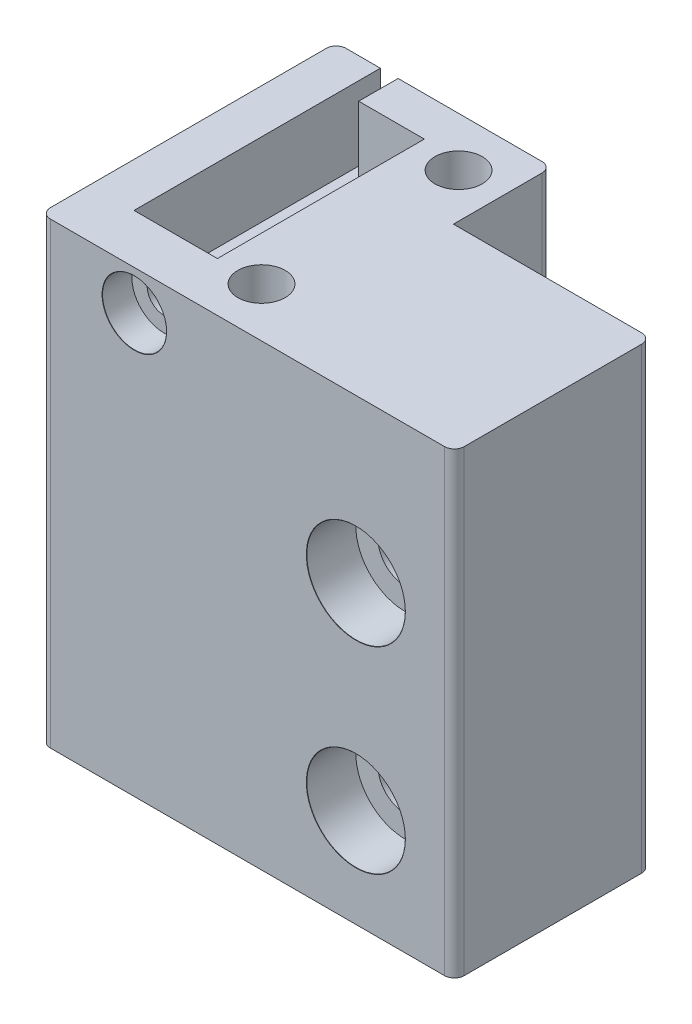
ISO-10303-21;
HEADER;
FILE_DESCRIPTION(('STEP AP214'),'2;1');
FILE_NAME('part.step','',(''),(''),'','','');
FILE_SCHEMA(('AUTOMOTIVE_DESIGN { 1 0 10303 214 1 1 1 1 }'));
ENDSEC;
DATA;
#1=APPLICATION_CONTEXT('core data for automotive mechanical design processes');
#2=APPLICATION_PROTOCOL_DEFINITION('international standard','automotive_design',2000,#1);
#3=PRODUCT_CONTEXT('',#1,'mechanical');
#4=PRODUCT('Part','Part','',(#3));
#5=PRODUCT_RELATED_PRODUCT_CATEGORY('part','',(#4));
#6=PRODUCT_DEFINITION_FORMATION('','',#4);
#7=PRODUCT_DEFINITION_CONTEXT('part definition',#1,'design');
#8=PRODUCT_DEFINITION('design','',#6,#7);
#9=PRODUCT_DEFINITION_SHAPE('','',#8);
#10=(LENGTH_UNIT() NAMED_UNIT(*) SI_UNIT(.MILLI.,.METRE.));
#11=(NAMED_UNIT(*) PLANE_ANGLE_UNIT() SI_UNIT($,.RADIAN.));
#12=(NAMED_UNIT(*) SI_UNIT($,.STERADIAN.) SOLID_ANGLE_UNIT());
#13=UNCERTAINTY_MEASURE_WITH_UNIT(LENGTH_MEASURE(1.E-05),#10,'distance_accuracy_value','');
#14=(GEOMETRIC_REPRESENTATION_CONTEXT(3) GLOBAL_UNCERTAINTY_ASSIGNED_CONTEXT((#13)) GLOBAL_UNIT_ASSIGNED_CONTEXT((#10,
#11,#12)) REPRESENTATION_CONTEXT('',''));
#15=CARTESIAN_POINT('',(0.,0.,0.));
#16=DIRECTION('',(0.,0.,1.));
#17=DIRECTION('',(1.,0.,0.));
#18=AXIS2_PLACEMENT_3D('',#15,#16,#17);
#19=CARTESIAN_POINT('',(-21.,40.,-10.));
#20=DIRECTION('',(1.,0.,0.));
#21=DIRECTION('',(0.,0.,-1.));
#22=AXIS2_PLACEMENT_3D('',#19,#20,#21);
#23=PLANE('',#22);
#24=DIRECTION('',(0.,0.,1.));
#25=VECTOR('',#24,1.);
#26=CARTESIAN_POINT('',(-21.,46.5,-10.));
#27=LINE('',#26,#25);
#28=CARTESIAN_POINT('',(-21.,46.5,-19.));
#29=VERTEX_POINT('',#28);
#30=CARTESIAN_POINT('',(-21.,46.5,9.00000000000001));
#31=VERTEX_POINT('',#30);
#32=EDGE_CURVE('E224',#29,#31,#27,.T.);
#33=ORIENTED_EDGE('',*,*,#32,.F.);
#34=DIRECTION('',(0.,1.,0.));
#35=VECTOR('',#34,1.);
#36=CARTESIAN_POINT('',(-21.,0.,-19.));
#37=LINE('',#36,#35);
#38=CARTESIAN_POINT('',(-21.,0.,-19.));
#39=VERTEX_POINT('',#38);
#40=EDGE_CURVE('E11',#29,#39,#37,.F.);
#41=ORIENTED_EDGE('',*,*,#40,.T.);
#42=DIRECTION('',(0.,0.,1.));
#43=VECTOR('',#42,1.);
#44=CARTESIAN_POINT('',(-21.,0.,-10.));
#45=LINE('',#44,#43);
#46=CARTESIAN_POINT('',(-21.,0.,9.00000000000001));
#47=VERTEX_POINT('',#46);
#48=EDGE_CURVE('E276',#39,#47,#45,.T.);
#49=ORIENTED_EDGE('',*,*,#48,.T.);
#50=DIRECTION('',(0.,-1.,0.));
#51=VECTOR('',#50,1.);
#52=CARTESIAN_POINT('',(-21.,40.,9.00000000000001));
#53=LINE('',#52,#51);
#54=EDGE_CURVE('E52',#47,#31,#53,.F.);
#55=ORIENTED_EDGE('',*,*,#54,.T.);
#56=EDGE_LOOP('',(#33,#41,#49,#55));
#57=FACE_BOUND('',#56,.T.);
#58=ADVANCED_FACE('F43',(#57),#23,.F.);
#59=CARTESIAN_POINT('',(21.,40.,10.));
#60=DIRECTION('',(0.,0.,-1.));
#61=DIRECTION('',(-1.,0.,0.));
#62=AXIS2_PLACEMENT_3D('',#59,#60,#61);
#63=PLANE('',#62);
#64=CARTESIAN_POINT('',(-11.4799999999989,42.5,10.));
#65=DIRECTION('',(0.,0.,1.));
#66=DIRECTION('',(1.,0.,0.));
#67=AXIS2_PLACEMENT_3D('',#64,#65,#66);
#68=CIRCLE('',#67,3.275);
#69=CARTESIAN_POINT('',(-8.20499999999888,42.5,10.));
#70=VERTEX_POINT('',#69);
#71=EDGE_CURVE('E445',#70,#70,#68,.T.);
#72=ORIENTED_EDGE('',*,*,#71,.F.);
#73=EDGE_LOOP('',(#72));
#74=FACE_BOUND('',#73,.T.);
#75=CARTESIAN_POINT('',(11.,30.,10.));
#76=DIRECTION('',(0.,0.,1.));
#77=DIRECTION('',(1.,0.,0.));
#78=AXIS2_PLACEMENT_3D('',#75,#76,#77);
#79=CIRCLE('',#78,5.025);
#80=CARTESIAN_POINT('',(16.025,30.,10.));
#81=VERTEX_POINT('',#80);
#82=EDGE_CURVE('E236',#81,#81,#79,.T.);
#83=ORIENTED_EDGE('',*,*,#82,.F.);
#84=EDGE_LOOP('',(#83));
#85=FACE_BOUND('',#84,.T.);
#86=CARTESIAN_POINT('',(11.,10.,10.));
#87=DIRECTION('',(0.,0.,1.));
#88=DIRECTION('',(1.,0.,0.));
#89=AXIS2_PLACEMENT_3D('',#86,#87,#88);
#90=CIRCLE('',#89,5.025);
#91=CARTESIAN_POINT('',(16.025,10.,10.));
#92=VERTEX_POINT('',#91);
#93=EDGE_CURVE('E256',#92,#92,#90,.T.);
#94=ORIENTED_EDGE('',*,*,#93,.F.);
#95=EDGE_LOOP('',(#94));
#96=FACE_BOUND('',#95,.T.);
#97=DIRECTION('',(1.,0.,0.));
#98=VECTOR('',#97,1.);
#99=CARTESIAN_POINT('',(21.,0.,10.));
#100=LINE('',#99,#98);
#101=CARTESIAN_POINT('',(-20.,0.,10.));
#102=VERTEX_POINT('',#101);
#103=CARTESIAN_POINT('',(20.,0.,10.));
#104=VERTEX_POINT('',#103);
#105=EDGE_CURVE('E280',#102,#104,#100,.T.);
#106=ORIENTED_EDGE('',*,*,#105,.T.);
#107=DIRECTION('',(0.,-1.,0.));
#108=VECTOR('',#107,1.);
#109=CARTESIAN_POINT('',(20.,40.,10.));
#110=LINE('',#109,#108);
#111=CARTESIAN_POINT('',(20.,46.5,10.));
#112=VERTEX_POINT('',#111);
#113=EDGE_CURVE('E344',#104,#112,#110,.F.);
#114=ORIENTED_EDGE('',*,*,#113,.T.);
#115=DIRECTION('',(1.,0.,0.));
#116=VECTOR('',#115,1.);
#117=CARTESIAN_POINT('',(-21.,46.5,10.));
#118=LINE('',#117,#116);
#119=CARTESIAN_POINT('',(-20.,46.5,10.));
#120=VERTEX_POINT('',#119);
#121=EDGE_CURVE('E228',#120,#112,#118,.T.);
#122=ORIENTED_EDGE('',*,*,#121,.F.);
#123=DIRECTION('',(0.,-1.,0.));
#124=VECTOR('',#123,1.);
#125=CARTESIAN_POINT('',(-20.,40.,10.));
#126=LINE('',#125,#124);
#127=EDGE_CURVE('E340',#120,#102,#126,.T.);
#128=ORIENTED_EDGE('',*,*,#127,.T.);
#129=EDGE_LOOP('',(#106,#114,#122,#128));
#130=FACE_BOUND('',#129,.T.);
#131=ADVANCED_FACE('F359',(#74,#85,#96,#130),#63,.F.);
#132=CARTESIAN_POINT('',(21.,40.,-10.));
#133=DIRECTION('',(-1.,0.,0.));
#134=DIRECTION('',(0.,0.,1.));
#135=AXIS2_PLACEMENT_3D('',#132,#133,#134);
#136=PLANE('',#135);
#137=DIRECTION('',(0.,0.,-1.));
#138=VECTOR('',#137,1.);
#139=CARTESIAN_POINT('',(21.,0.,-10.));
#140=LINE('',#139,#138);
#141=CARTESIAN_POINT('',(21.,0.,9.));
#142=VERTEX_POINT('',#141);
#143=CARTESIAN_POINT('',(21.,0.,-9.00000000000001));
#144=VERTEX_POINT('',#143);
#145=EDGE_CURVE('E284',#142,#144,#140,.T.);
#146=ORIENTED_EDGE('',*,*,#145,.T.);
#147=DIRECTION('',(0.,-1.,0.));
#148=VECTOR('',#147,1.);
#149=CARTESIAN_POINT('',(21.,40.,-9.00000000000001));
#150=LINE('',#149,#148);
#151=CARTESIAN_POINT('',(21.,46.5,-9.00000000000001));
#152=VERTEX_POINT('',#151);
#153=EDGE_CURVE('E314',#144,#152,#150,.F.);
#154=ORIENTED_EDGE('',*,*,#153,.T.);
#155=DIRECTION('',(0.,0.,-1.));
#156=VECTOR('',#155,1.);
#157=CARTESIAN_POINT('',(21.,46.5,10.));
#158=LINE('',#157,#156);
#159=CARTESIAN_POINT('',(21.,46.5,9.));
#160=VERTEX_POINT('',#159);
#161=EDGE_CURVE('E232',#160,#152,#158,.T.);
#162=ORIENTED_EDGE('',*,*,#161,.F.);
#163=DIRECTION('',(0.,-1.,0.));
#164=VECTOR('',#163,1.);
#165=CARTESIAN_POINT('',(21.,40.,9.));
#166=LINE('',#165,#164);
#167=EDGE_CURVE('E310',#160,#142,#166,.T.);
#168=ORIENTED_EDGE('',*,*,#167,.T.);
#169=EDGE_LOOP('',(#146,#154,#162,#168));
#170=FACE_BOUND('',#169,.T.);
#171=ADVANCED_FACE('F371',(#170),#136,.F.);
#172=CARTESIAN_POINT('',(21.,40.,-10.));
#173=DIRECTION('',(0.,0.,1.));
#174=DIRECTION('',(1.,0.,0.));
#175=AXIS2_PLACEMENT_3D('',#172,#173,#174);
#176=PLANE('',#175);
#177=CARTESIAN_POINT('',(11.,30.,-10.));
#178=DIRECTION('',(0.,0.,1.));
#179=DIRECTION('',(1.,0.,0.));
#180=AXIS2_PLACEMENT_3D('',#177,#178,#179);
#181=CIRCLE('',#180,2.75);
#182=CARTESIAN_POINT('',(13.75,30.,-10.));
#183=VERTEX_POINT('',#182);
#184=EDGE_CURVE('E252',#183,#183,#181,.T.);
#185=ORIENTED_EDGE('',*,*,#184,.T.);
#186=EDGE_LOOP('',(#185));
#187=FACE_BOUND('',#186,.T.);
#188=CARTESIAN_POINT('',(11.,10.,-10.));
#189=DIRECTION('',(0.,0.,1.));
#190=DIRECTION('',(1.,0.,0.));
#191=AXIS2_PLACEMENT_3D('',#188,#189,#190);
#192=CIRCLE('',#191,2.75);
#193=CARTESIAN_POINT('',(13.75,10.,-10.));
#194=VERTEX_POINT('',#193);
#195=EDGE_CURVE('E272',#194,#194,#192,.T.);
#196=ORIENTED_EDGE('',*,*,#195,.T.);
#197=EDGE_LOOP('',(#196));
#198=FACE_BOUND('',#197,.T.);
#199=DIRECTION('',(-1.,0.,0.));
#200=VECTOR('',#199,1.);
#201=CARTESIAN_POINT('',(21.,46.5,-10.));
#202=LINE('',#201,#200);
#203=CARTESIAN_POINT('',(20.,46.5,-10.));
#204=VERTEX_POINT('',#203);
#205=CARTESIAN_POINT('',(0.900000000000008,46.5,-10.));
#206=VERTEX_POINT('',#205);
#207=EDGE_CURVE('E214',#204,#206,#202,.T.);
#208=ORIENTED_EDGE('',*,*,#207,.F.);
#209=DIRECTION('',(0.,-1.,0.));
#210=VECTOR('',#209,1.);
#211=CARTESIAN_POINT('',(20.,40.,-10.));
#212=LINE('',#211,#210);
#213=CARTESIAN_POINT('',(20.,0.,-10.));
#214=VERTEX_POINT('',#213);
#215=EDGE_CURVE('E291',#204,#214,#212,.T.);
#216=ORIENTED_EDGE('',*,*,#215,.T.);
#217=DIRECTION('',(-1.,0.,0.));
#218=VECTOR('',#217,1.);
#219=CARTESIAN_POINT('',(21.,0.,-10.));
#220=LINE('',#219,#218);
#221=CARTESIAN_POINT('',(0.900000000000001,0.,-10.));
#222=VERTEX_POINT('',#221);
#223=EDGE_CURVE('E288',#214,#222,#220,.T.);
#224=ORIENTED_EDGE('',*,*,#223,.T.);
#225=DIRECTION('',(0.,1.,0.));
#226=VECTOR('',#225,1.);
#227=CARTESIAN_POINT('',(0.900000000000001,-24.0750908617185,-10.));
#228=LINE('',#227,#226);
#229=EDGE_CURVE('E205',#222,#206,#228,.T.);
#230=ORIENTED_EDGE('',*,*,#229,.T.);
#231=EDGE_LOOP('',(#208,#216,#224,#230));
#232=FACE_BOUND('',#231,.T.);
#233=ADVANCED_FACE('F379',(#187,#198,#232),#176,.F.);
#234=CARTESIAN_POINT('',(0.,0.,0.));
#235=DIRECTION('',(0.,-1.,0.));
#236=DIRECTION('',(0.,0.,-1.));
#237=AXIS2_PLACEMENT_3D('',#234,#235,#236);
#238=PLANE('',#237);
#239=ORIENTED_EDGE('',*,*,#223,.F.);
#240=CARTESIAN_POINT('',(20.,0.,-9.00000000000001));
#241=DIRECTION('',(0.,-1.,0.));
#242=DIRECTION('',(0.,0.,-1.));
#243=AXIS2_PLACEMENT_3D('',#240,#241,#242);
#244=CIRCLE('',#243,1.);
#245=EDGE_CURVE('E307',#214,#144,#244,.T.);
#246=ORIENTED_EDGE('',*,*,#245,.T.);
#247=ORIENTED_EDGE('',*,*,#145,.F.);
#248=CARTESIAN_POINT('',(20.,0.,9.));
#249=DIRECTION('',(0.,-1.,0.));
#250=DIRECTION('',(0.,0.,-1.));
#251=AXIS2_PLACEMENT_3D('',#248,#249,#250);
#252=CIRCLE('',#251,1.);
#253=EDGE_CURVE('E301',#142,#104,#252,.T.);
#254=ORIENTED_EDGE('',*,*,#253,.T.);
#255=ORIENTED_EDGE('',*,*,#105,.F.);
#256=CARTESIAN_POINT('',(-20.,0.,9.));
#257=DIRECTION('',(0.,-1.,0.));
#258=DIRECTION('',(0.,0.,-1.));
#259=AXIS2_PLACEMENT_3D('',#256,#257,#258);
#260=CIRCLE('',#259,1.);
#261=EDGE_CURVE('E295',#102,#47,#260,.T.);
#262=ORIENTED_EDGE('',*,*,#261,.T.);
#263=ORIENTED_EDGE('',*,*,#48,.F.);
#264=CARTESIAN_POINT('',(-20.,0.,-19.));
#265=DIRECTION('',(0.,-1.,0.));
#266=DIRECTION('',(0.,0.,-1.));
#267=AXIS2_PLACEMENT_3D('',#264,#265,#266);
#268=CIRCLE('',#267,1.);
#269=CARTESIAN_POINT('',(-20.,0.,-20.));
#270=VERTEX_POINT('',#269);
#271=EDGE_CURVE('E298',#39,#270,#268,.T.);
#272=ORIENTED_EDGE('',*,*,#271,.T.);
#273=DIRECTION('',(-1.,0.,0.));
#274=VECTOR('',#273,1.);
#275=CARTESIAN_POINT('',(-21.,0.,-20.));
#276=LINE('',#275,#274);
#277=CARTESIAN_POINT('',(-0.0999999999999994,0.,-20.));
#278=VERTEX_POINT('',#277);
#279=EDGE_CURVE('E210',#278,#270,#276,.T.);
#280=ORIENTED_EDGE('',*,*,#279,.F.);
#281=CARTESIAN_POINT('',(-0.0999999999999985,0.,-19.));
#282=DIRECTION('',(0.,-1.,0.));
#283=DIRECTION('',(0.,0.,-1.));
#284=AXIS2_PLACEMENT_3D('',#281,#282,#283);
#285=CIRCLE('',#284,1.);
#286=CARTESIAN_POINT('',(0.900000000000001,0.,-19.));
#287=VERTEX_POINT('',#286);
#288=EDGE_CURVE('E304',#278,#287,#285,.T.);
#289=ORIENTED_EDGE('',*,*,#288,.T.);
#290=DIRECTION('',(0.,0.,-1.));
#291=VECTOR('',#290,1.);
#292=CARTESIAN_POINT('',(0.900000000000001,0.,-10.));
#293=LINE('',#292,#291);
#294=EDGE_CURVE('E215',#222,#287,#293,.T.);
#295=ORIENTED_EDGE('',*,*,#294,.F.);
#296=EDGE_LOOP('',(#239,#246,#247,#254,#255,#262,#263,#272,#280,#289,#295));
#297=FACE_BOUND('',#296,.T.);
#298=ADVANCED_FACE('F363',(#297),#238,.T.);
#299=CARTESIAN_POINT('',(11.,10.,10.));
#300=DIRECTION('',(0.,0.,1.));
#301=DIRECTION('',(1.,0.,0.));
#302=AXIS2_PLACEMENT_3D('',#299,#300,#301);
#303=CYLINDRICAL_SURFACE('',#302,2.75);
#304=ORIENTED_EDGE('',*,*,#195,.F.);
#305=EDGE_LOOP('',(#304));
#306=FACE_BOUND('',#305,.T.);
#307=CARTESIAN_POINT('',(11.,10.,5.));
#308=DIRECTION('',(0.,0.,1.));
#309=DIRECTION('',(1.,0.,0.));
#310=AXIS2_PLACEMENT_3D('',#307,#308,#309);
#311=CIRCLE('',#310,2.75);
#312=CARTESIAN_POINT('',(13.75,10.,5.));
#313=VERTEX_POINT('',#312);
#314=EDGE_CURVE('E268',#313,#313,#311,.T.);
#315=ORIENTED_EDGE('',*,*,#314,.T.);
#316=EDGE_LOOP('',(#315));
#317=FACE_BOUND('',#316,.T.);
#318=ADVANCED_FACE('F610',(#306,#317),#303,.F.);
#319=CARTESIAN_POINT('',(16.,10.,5.));
#320=DIRECTION('',(0.,0.,-1.));
#321=DIRECTION('',(-1.,0.,0.));
#322=AXIS2_PLACEMENT_3D('',#319,#320,#321);
#323=PLANE('',#322);
#324=ORIENTED_EDGE('',*,*,#314,.F.);
#325=EDGE_LOOP('',(#324));
#326=FACE_BOUND('',#325,.T.);
#327=CARTESIAN_POINT('',(11.,10.,5.));
#328=DIRECTION('',(0.,0.,1.));
#329=DIRECTION('',(1.,0.,0.));
#330=AXIS2_PLACEMENT_3D('',#327,#328,#329);
#331=CIRCLE('',#330,5.);
#332=CARTESIAN_POINT('',(16.,10.,5.));
#333=VERTEX_POINT('',#332);
#334=EDGE_CURVE('E264',#333,#333,#331,.T.);
#335=ORIENTED_EDGE('',*,*,#334,.T.);
#336=EDGE_LOOP('',(#335));
#337=FACE_BOUND('',#336,.T.);
#338=ADVANCED_FACE('F606',(#326,#337),#323,.F.);
#339=CARTESIAN_POINT('',(11.,10.,10.));
#340=DIRECTION('',(0.,0.,1.));
#341=DIRECTION('',(1.,0.,0.));
#342=AXIS2_PLACEMENT_3D('',#339,#340,#341);
#343=CYLINDRICAL_SURFACE('',#342,5.);
#344=ORIENTED_EDGE('',*,*,#334,.F.);
#345=EDGE_LOOP('',(#344));
#346=FACE_BOUND('',#345,.T.);
#347=CARTESIAN_POINT('',(11.,10.,9.97902250922057));
#348=DIRECTION('',(0.,0.,1.));
#349=DIRECTION('',(1.,0.,0.));
#350=AXIS2_PLACEMENT_3D('',#347,#348,#349);
#351=CIRCLE('',#350,5.);
#352=CARTESIAN_POINT('',(16.,10.,9.97902250922057));
#353=VERTEX_POINT('',#352);
#354=EDGE_CURVE('E260',#353,#353,#351,.T.);
#355=ORIENTED_EDGE('',*,*,#354,.T.);
#356=EDGE_LOOP('',(#355));
#357=FACE_BOUND('',#356,.T.);
#358=ADVANCED_FACE('F602',(#346,#357),#343,.F.);
#359=CARTESIAN_POINT('',(11.,10.,10.));
#360=DIRECTION('',(0.,0.,1.));
#361=DIRECTION('',(1.,0.,0.));
#362=AXIS2_PLACEMENT_3D('',#359,#360,#361);
#363=CONICAL_SURFACE('',#362,5.025,0.872664625997186);
#364=ORIENTED_EDGE('',*,*,#354,.F.);
#365=EDGE_LOOP('',(#364));
#366=FACE_BOUND('',#365,.T.);
#367=ORIENTED_EDGE('',*,*,#93,.T.);
#368=EDGE_LOOP('',(#367));
#369=FACE_BOUND('',#368,.T.);
#370=ADVANCED_FACE('F598',(#366,#369),#363,.F.);
#371=CARTESIAN_POINT('',(11.,30.,10.));
#372=DIRECTION('',(0.,0.,1.));
#373=DIRECTION('',(1.,0.,0.));
#374=AXIS2_PLACEMENT_3D('',#371,#372,#373);
#375=CYLINDRICAL_SURFACE('',#374,2.75);
#376=ORIENTED_EDGE('',*,*,#184,.F.);
#377=EDGE_LOOP('',(#376));
#378=FACE_BOUND('',#377,.T.);
#379=CARTESIAN_POINT('',(11.,30.,5.));
#380=DIRECTION('',(0.,0.,1.));
#381=DIRECTION('',(1.,0.,0.));
#382=AXIS2_PLACEMENT_3D('',#379,#380,#381);
#383=CIRCLE('',#382,2.75);
#384=CARTESIAN_POINT('',(13.75,30.,5.));
#385=VERTEX_POINT('',#384);
#386=EDGE_CURVE('E248',#385,#385,#383,.T.);
#387=ORIENTED_EDGE('',*,*,#386,.T.);
#388=EDGE_LOOP('',(#387));
#389=FACE_BOUND('',#388,.T.);
#390=ADVANCED_FACE('F594',(#378,#389),#375,.F.);
#391=CARTESIAN_POINT('',(16.,30.,5.));
#392=DIRECTION('',(0.,0.,-1.));
#393=DIRECTION('',(-1.,0.,0.));
#394=AXIS2_PLACEMENT_3D('',#391,#392,#393);
#395=PLANE('',#394);
#396=ORIENTED_EDGE('',*,*,#386,.F.);
#397=EDGE_LOOP('',(#396));
#398=FACE_BOUND('',#397,.T.);
#399=CARTESIAN_POINT('',(11.,30.,5.));
#400=DIRECTION('',(0.,0.,1.));
#401=DIRECTION('',(1.,0.,0.));
#402=AXIS2_PLACEMENT_3D('',#399,#400,#401);
#403=CIRCLE('',#402,5.);
#404=CARTESIAN_POINT('',(16.,30.,5.));
#405=VERTEX_POINT('',#404);
#406=EDGE_CURVE('E244',#405,#405,#403,.T.);
#407=ORIENTED_EDGE('',*,*,#406,.T.);
#408=EDGE_LOOP('',(#407));
#409=FACE_BOUND('',#408,.T.);
#410=ADVANCED_FACE('F590',(#398,#409),#395,.F.);
#411=CARTESIAN_POINT('',(11.,30.,10.));
#412=DIRECTION('',(0.,0.,1.));
#413=DIRECTION('',(1.,0.,0.));
#414=AXIS2_PLACEMENT_3D('',#411,#412,#413);
#415=CYLINDRICAL_SURFACE('',#414,5.);
#416=ORIENTED_EDGE('',*,*,#406,.F.);
#417=EDGE_LOOP('',(#416));
#418=FACE_BOUND('',#417,.T.);
#419=CARTESIAN_POINT('',(11.,30.,9.97902250922057));
#420=DIRECTION('',(0.,0.,1.));
#421=DIRECTION('',(1.,0.,0.));
#422=AXIS2_PLACEMENT_3D('',#419,#420,#421);
#423=CIRCLE('',#422,5.);
#424=CARTESIAN_POINT('',(16.,30.,9.97902250922057));
#425=VERTEX_POINT('',#424);
#426=EDGE_CURVE('E240',#425,#425,#423,.T.);
#427=ORIENTED_EDGE('',*,*,#426,.T.);
#428=EDGE_LOOP('',(#427));
#429=FACE_BOUND('',#428,.T.);
#430=ADVANCED_FACE('F586',(#418,#429),#415,.F.);
#431=CARTESIAN_POINT('',(11.,30.,10.));
#432=DIRECTION('',(0.,0.,1.));
#433=DIRECTION('',(1.,0.,0.));
#434=AXIS2_PLACEMENT_3D('',#431,#432,#433);
#435=CONICAL_SURFACE('',#434,5.025,0.872664625997186);
#436=ORIENTED_EDGE('',*,*,#426,.F.);
#437=EDGE_LOOP('',(#436));
#438=FACE_BOUND('',#437,.T.);
#439=ORIENTED_EDGE('',*,*,#82,.T.);
#440=EDGE_LOOP('',(#439));
#441=FACE_BOUND('',#440,.T.);
#442=ADVANCED_FACE('F508',(#438,#441),#435,.F.);
#443=CARTESIAN_POINT('',(0.,46.5,0.));
#444=DIRECTION('',(0.,1.,0.));
#445=DIRECTION('',(0.,0.,1.));
#446=AXIS2_PLACEMENT_3D('',#443,#444,#445);
#447=PLANE('',#446);
#448=CARTESIAN_POINT('',(-3.57499999999999,46.5,-15.));
#449=DIRECTION('',(0.,1.,0.));
#450=DIRECTION('',(0.,0.,1.));
#451=AXIS2_PLACEMENT_3D('',#448,#449,#450);
#452=CIRCLE('',#451,2.4);
#453=CARTESIAN_POINT('',(-3.57499999999999,46.5,-12.6));
#454=VERTEX_POINT('',#453);
#455=EDGE_CURVE('E462',#454,#454,#452,.T.);
#456=ORIENTED_EDGE('',*,*,#455,.F.);
#457=EDGE_LOOP('',(#456));
#458=FACE_BOUND('',#457,.T.);
#459=CARTESIAN_POINT('',(-3.57499999999999,46.5,5.));
#460=DIRECTION('',(0.,1.,0.));
#461=DIRECTION('',(0.,0.,1.));
#462=AXIS2_PLACEMENT_3D('',#459,#460,#461);
#463=CIRCLE('',#462,2.4);
#464=CARTESIAN_POINT('',(-3.57499999999999,46.5,7.4));
#465=VERTEX_POINT('',#464);
#466=EDGE_CURVE('E457',#465,#465,#463,.T.);
#467=ORIENTED_EDGE('',*,*,#466,.F.);
#468=EDGE_LOOP('',(#467));
#469=FACE_BOUND('',#468,.T.);
#470=ORIENTED_EDGE('',*,*,#161,.T.);
#471=CARTESIAN_POINT('',(20.,46.5,-9.00000000000001));
#472=DIRECTION('',(0.,1.,0.));
#473=DIRECTION('',(0.,0.,1.));
#474=AXIS2_PLACEMENT_3D('',#471,#472,#473);
#475=CIRCLE('',#474,1.);
#476=EDGE_CURVE('E328',#152,#204,#475,.T.);
#477=ORIENTED_EDGE('',*,*,#476,.T.);
#478=ORIENTED_EDGE('',*,*,#207,.T.);
#479=DIRECTION('',(0.,0.,-1.));
#480=VECTOR('',#479,1.);
#481=CARTESIAN_POINT('',(0.900000000000001,46.5,-10.));
#482=LINE('',#481,#480);
#483=CARTESIAN_POINT('',(0.900000000000001,46.5,-19.));
#484=VERTEX_POINT('',#483);
#485=EDGE_CURVE('E206',#206,#484,#482,.T.);
#486=ORIENTED_EDGE('',*,*,#485,.T.);
#487=CARTESIAN_POINT('',(-0.0999999999999985,46.5,-19.));
#488=DIRECTION('',(0.,1.,0.));
#489=DIRECTION('',(0.,0.,1.));
#490=AXIS2_PLACEMENT_3D('',#487,#488,#489);
#491=CIRCLE('',#490,1.);
#492=CARTESIAN_POINT('',(-0.0999999999999994,46.5,-20.));
#493=VERTEX_POINT('',#492);
#494=EDGE_CURVE('E59',#484,#493,#491,.T.);
#495=ORIENTED_EDGE('',*,*,#494,.T.);
#496=DIRECTION('',(-1.,0.,0.));
#497=VECTOR('',#496,1.);
#498=CARTESIAN_POINT('',(-21.,46.5,-20.));
#499=LINE('',#498,#497);
#500=CARTESIAN_POINT('',(-14.71,46.5,-20.));
#501=VERTEX_POINT('',#500);
#502=EDGE_CURVE('E202',#493,#501,#499,.T.);
#503=ORIENTED_EDGE('',*,*,#502,.T.);
#504=DIRECTION('',(0.,0.,-1.));
#505=VECTOR('',#504,1.);
#506=CARTESIAN_POINT('',(-14.71,46.5,-16.));
#507=LINE('',#506,#505);
#508=CARTESIAN_POINT('',(-14.71,46.5,-16.));
#509=VERTEX_POINT('',#508);
#510=EDGE_CURVE('E185',#509,#501,#507,.T.);
#511=ORIENTED_EDGE('',*,*,#510,.F.);
#512=DIRECTION('',(-1.,0.,0.));
#513=VECTOR('',#512,1.);
#514=CARTESIAN_POINT('',(-8.05,46.5,-16.));
#515=LINE('',#514,#513);
#516=CARTESIAN_POINT('',(-8.05,46.5,-16.));
#517=VERTEX_POINT('',#516);
#518=EDGE_CURVE('E412',#517,#509,#515,.T.);
#519=ORIENTED_EDGE('',*,*,#518,.F.);
#520=DIRECTION('',(0.,0.,-1.));
#521=VECTOR('',#520,1.);
#522=CARTESIAN_POINT('',(-8.05,46.5,5.));
#523=LINE('',#522,#521);
#524=CARTESIAN_POINT('',(-8.05,46.5,5.));
#525=VERTEX_POINT('',#524);
#526=EDGE_CURVE('E416',#525,#517,#523,.T.);
#527=ORIENTED_EDGE('',*,*,#526,.F.);
#528=DIRECTION('',(1.,0.,0.));
#529=VECTOR('',#528,1.);
#530=CARTESIAN_POINT('',(-16.51,46.5,5.));
#531=LINE('',#530,#529);
#532=CARTESIAN_POINT('',(-16.51,46.5,5.));
#533=VERTEX_POINT('',#532);
#534=EDGE_CURVE('E419',#533,#525,#531,.T.);
#535=ORIENTED_EDGE('',*,*,#534,.F.);
#536=DIRECTION('',(0.,0.,1.));
#537=VECTOR('',#536,1.);
#538=CARTESIAN_POINT('',(-16.51,46.5,-20.));
#539=LINE('',#538,#537);
#540=CARTESIAN_POINT('',(-16.51,46.5,-20.));
#541=VERTEX_POINT('',#540);
#542=EDGE_CURVE('E393',#541,#533,#539,.T.);
#543=ORIENTED_EDGE('',*,*,#542,.F.);
#544=CARTESIAN_POINT('',(-20.,46.5,-20.));
#545=VERTEX_POINT('',#544);
#546=EDGE_CURVE('E191',#541,#545,#499,.T.);
#547=ORIENTED_EDGE('',*,*,#546,.T.);
#548=CARTESIAN_POINT('',(-20.,46.5,-19.));
#549=DIRECTION('',(0.,1.,0.));
#550=DIRECTION('',(0.,0.,1.));
#551=AXIS2_PLACEMENT_3D('',#548,#549,#550);
#552=CIRCLE('',#551,1.);
#553=EDGE_CURVE('E320',#545,#29,#552,.T.);
#554=ORIENTED_EDGE('',*,*,#553,.T.);
#555=ORIENTED_EDGE('',*,*,#32,.T.);
#556=CARTESIAN_POINT('',(-20.,46.5,9.));
#557=DIRECTION('',(0.,1.,0.));
#558=DIRECTION('',(0.,0.,1.));
#559=AXIS2_PLACEMENT_3D('',#556,#557,#558);
#560=CIRCLE('',#559,1.);
#561=EDGE_CURVE('E317',#31,#120,#560,.T.);
#562=ORIENTED_EDGE('',*,*,#561,.T.);
#563=ORIENTED_EDGE('',*,*,#121,.T.);
#564=CARTESIAN_POINT('',(20.,46.5,9.));
#565=DIRECTION('',(0.,1.,0.));
#566=DIRECTION('',(0.,0.,1.));
#567=AXIS2_PLACEMENT_3D('',#564,#565,#566);
#568=CIRCLE('',#567,1.);
#569=EDGE_CURVE('E323',#112,#160,#568,.T.);
#570=ORIENTED_EDGE('',*,*,#569,.T.);
#571=EDGE_LOOP('',(#470,#477,#478,#486,#495,#503,#511,#519,#527,#535,#543,#547,#554,#555,#562,
#563,#570));
#572=FACE_BOUND('',#571,.T.);
#573=ADVANCED_FACE('F354',(#458,#469,#572),#447,.T.);
#574=CARTESIAN_POINT('',(0.900000000000001,-24.0750908617185,-10.));
#575=DIRECTION('',(1.,0.,0.));
#576=DIRECTION('',(0.,0.,-1.));
#577=AXIS2_PLACEMENT_3D('',#574,#575,#576);
#578=PLANE('',#577);
#579=ORIENTED_EDGE('',*,*,#294,.T.);
#580=DIRECTION('',(0.,1.,0.));
#581=VECTOR('',#580,1.);
#582=CARTESIAN_POINT('',(0.900000000000001,-24.0750908617185,-19.));
#583=LINE('',#582,#581);
#584=EDGE_CURVE('E331',#287,#484,#583,.T.);
#585=ORIENTED_EDGE('',*,*,#584,.T.);
#586=ORIENTED_EDGE('',*,*,#485,.F.);
#587=ORIENTED_EDGE('',*,*,#229,.F.);
#588=EDGE_LOOP('',(#579,#585,#586,#587));
#589=FACE_BOUND('',#588,.T.);
#590=ADVANCED_FACE('F386',(#589),#578,.T.);
#591=CARTESIAN_POINT('',(-21.,-24.0750908617185,-20.));
#592=DIRECTION('',(0.,0.,-1.));
#593=DIRECTION('',(-1.,0.,0.));
#594=AXIS2_PLACEMENT_3D('',#591,#592,#593);
#595=PLANE('',#594);
#596=ORIENTED_EDGE('',*,*,#502,.F.);
#597=DIRECTION('',(0.,1.,0.));
#598=VECTOR('',#597,1.);
#599=CARTESIAN_POINT('',(-0.0999999999999994,-24.0750908617185,-20.));
#600=LINE('',#599,#598);
#601=EDGE_CURVE('E337',#493,#278,#600,.F.);
#602=ORIENTED_EDGE('',*,*,#601,.T.);
#603=ORIENTED_EDGE('',*,*,#279,.T.);
#604=DIRECTION('',(0.,1.,0.));
#605=VECTOR('',#604,1.);
#606=CARTESIAN_POINT('',(-20.,46.5,-20.));
#607=LINE('',#606,#605);
#608=EDGE_CURVE('E334',#270,#545,#607,.T.);
#609=ORIENTED_EDGE('',*,*,#608,.T.);
#610=ORIENTED_EDGE('',*,*,#546,.F.);
#611=DIRECTION('',(0.,1.,0.));
#612=VECTOR('',#611,1.);
#613=CARTESIAN_POINT('',(-16.51,39.,-20.));
#614=LINE('',#613,#612);
#615=CARTESIAN_POINT('',(-16.51,39.,-20.));
#616=VERTEX_POINT('',#615);
#617=EDGE_CURVE('E166',#616,#541,#614,.T.);
#618=ORIENTED_EDGE('',*,*,#617,.F.);
#619=DIRECTION('',(-1.,0.,0.));
#620=VECTOR('',#619,1.);
#621=CARTESIAN_POINT('',(-16.51,39.,-20.));
#622=LINE('',#621,#620);
#623=CARTESIAN_POINT('',(-14.71,39.,-20.));
#624=VERTEX_POINT('',#623);
#625=EDGE_CURVE('E174',#624,#616,#622,.T.);
#626=ORIENTED_EDGE('',*,*,#625,.F.);
#627=DIRECTION('',(0.,1.,0.));
#628=VECTOR('',#627,1.);
#629=CARTESIAN_POINT('',(-14.71,39.,-20.));
#630=LINE('',#629,#628);
#631=EDGE_CURVE('E209',#624,#501,#630,.T.);
#632=ORIENTED_EDGE('',*,*,#631,.T.);
#633=EDGE_LOOP('',(#596,#602,#603,#609,#610,#618,#626,#632));
#634=FACE_BOUND('',#633,.T.);
#635=ADVANCED_FACE('F188',(#634),#595,.T.);
#636=CARTESIAN_POINT('',(-14.71,39.,-16.));
#637=DIRECTION('',(1.,0.,0.));
#638=DIRECTION('',(0.,0.,-1.));
#639=AXIS2_PLACEMENT_3D('',#636,#637,#638);
#640=PLANE('',#639);
#641=ORIENTED_EDGE('',*,*,#510,.T.);
#642=ORIENTED_EDGE('',*,*,#631,.F.);
#643=DIRECTION('',(0.,0.,-1.));
#644=VECTOR('',#643,1.);
#645=CARTESIAN_POINT('',(-14.71,39.,-16.));
#646=LINE('',#645,#644);
#647=CARTESIAN_POINT('',(-14.71,39.,-16.));
#648=VERTEX_POINT('',#647);
#649=EDGE_CURVE('E180',#648,#624,#646,.T.);
#650=ORIENTED_EDGE('',*,*,#649,.F.);
#651=DIRECTION('',(0.,1.,0.));
#652=VECTOR('',#651,1.);
#653=CARTESIAN_POINT('',(-14.71,39.,-16.));
#654=LINE('',#653,#652);
#655=EDGE_CURVE('E397',#648,#509,#654,.T.);
#656=ORIENTED_EDGE('',*,*,#655,.T.);
#657=EDGE_LOOP('',(#641,#642,#650,#656));
#658=FACE_BOUND('',#657,.T.);
#659=ADVANCED_FACE('F564',(#658),#640,.F.);
#660=CARTESIAN_POINT('',(-8.05,39.,-16.));
#661=DIRECTION('',(0.,0.,-1.));
#662=DIRECTION('',(-1.,0.,0.));
#663=AXIS2_PLACEMENT_3D('',#660,#661,#662);
#664=PLANE('',#663);
#665=ORIENTED_EDGE('',*,*,#518,.T.);
#666=ORIENTED_EDGE('',*,*,#655,.F.);
#667=DIRECTION('',(-1.,0.,0.));
#668=VECTOR('',#667,1.);
#669=CARTESIAN_POINT('',(-8.05,39.,-16.));
#670=LINE('',#669,#668);
#671=CARTESIAN_POINT('',(-8.05,39.,-16.));
#672=VERTEX_POINT('',#671);
#673=EDGE_CURVE('E198',#672,#648,#670,.T.);
#674=ORIENTED_EDGE('',*,*,#673,.F.);
#675=DIRECTION('',(0.,1.,0.));
#676=VECTOR('',#675,1.);
#677=CARTESIAN_POINT('',(-8.05,39.,-16.));
#678=LINE('',#677,#676);
#679=EDGE_CURVE('E400',#672,#517,#678,.T.);
#680=ORIENTED_EDGE('',*,*,#679,.T.);
#681=EDGE_LOOP('',(#665,#666,#674,#680));
#682=FACE_BOUND('',#681,.T.);
#683=ADVANCED_FACE('F567',(#682),#664,.F.);
#684=CARTESIAN_POINT('',(-8.05,39.,5.));
#685=DIRECTION('',(1.,0.,0.));
#686=DIRECTION('',(0.,0.,-1.));
#687=AXIS2_PLACEMENT_3D('',#684,#685,#686);
#688=PLANE('',#687);
#689=ORIENTED_EDGE('',*,*,#526,.T.);
#690=ORIENTED_EDGE('',*,*,#679,.F.);
#691=DIRECTION('',(0.,0.,-1.));
#692=VECTOR('',#691,1.);
#693=CARTESIAN_POINT('',(-8.05,39.,5.));
#694=LINE('',#693,#692);
#695=CARTESIAN_POINT('',(-8.05,39.,5.));
#696=VERTEX_POINT('',#695);
#697=EDGE_CURVE('E427',#696,#672,#694,.T.);
#698=ORIENTED_EDGE('',*,*,#697,.F.);
#699=DIRECTION('',(0.,1.,0.));
#700=VECTOR('',#699,1.);
#701=CARTESIAN_POINT('',(-8.05,39.,5.));
#702=LINE('',#701,#700);
#703=EDGE_CURVE('E196',#696,#525,#702,.T.);
#704=ORIENTED_EDGE('',*,*,#703,.T.);
#705=EDGE_LOOP('',(#689,#690,#698,#704));
#706=FACE_BOUND('',#705,.T.);
#707=ADVANCED_FACE('F571',(#706),#688,.F.);
#708=CARTESIAN_POINT('',(-16.51,39.,5.));
#709=DIRECTION('',(0.,0.,1.));
#710=DIRECTION('',(1.,0.,0.));
#711=AXIS2_PLACEMENT_3D('',#708,#709,#710);
#712=PLANE('',#711);
#713=CARTESIAN_POINT('',(-11.4799999999989,42.5,5.));
#714=DIRECTION('',(0.,0.,1.));
#715=DIRECTION('',(1.,0.,0.));
#716=AXIS2_PLACEMENT_3D('',#713,#714,#715);
#717=CIRCLE('',#716,1.7);
#718=CARTESIAN_POINT('',(-9.77999999999889,42.5,5.));
#719=VERTEX_POINT('',#718);
#720=EDGE_CURVE('E423',#719,#719,#717,.F.);
#721=ORIENTED_EDGE('',*,*,#720,.F.);
#722=EDGE_LOOP('',(#721));
#723=FACE_BOUND('',#722,.T.);
#724=ORIENTED_EDGE('',*,*,#534,.T.);
#725=ORIENTED_EDGE('',*,*,#703,.F.);
#726=DIRECTION('',(1.,0.,0.));
#727=VECTOR('',#726,1.);
#728=CARTESIAN_POINT('',(-16.51,39.,5.));
#729=LINE('',#728,#727);
#730=CARTESIAN_POINT('',(-16.51,39.,5.));
#731=VERTEX_POINT('',#730);
#732=EDGE_CURVE('E173',#731,#696,#729,.T.);
#733=ORIENTED_EDGE('',*,*,#732,.F.);
#734=DIRECTION('',(0.,1.,0.));
#735=VECTOR('',#734,1.);
#736=CARTESIAN_POINT('',(-16.51,39.,5.));
#737=LINE('',#736,#735);
#738=EDGE_CURVE('E168',#731,#533,#737,.T.);
#739=ORIENTED_EDGE('',*,*,#738,.T.);
#740=EDGE_LOOP('',(#724,#725,#733,#739));
#741=FACE_BOUND('',#740,.T.);
#742=ADVANCED_FACE('F575',(#723,#741),#712,.F.);
#743=CARTESIAN_POINT('',(-16.51,39.,-20.));
#744=DIRECTION('',(-1.,0.,0.));
#745=DIRECTION('',(0.,0.,1.));
#746=AXIS2_PLACEMENT_3D('',#743,#744,#745);
#747=PLANE('',#746);
#748=ORIENTED_EDGE('',*,*,#542,.T.);
#749=ORIENTED_EDGE('',*,*,#738,.F.);
#750=DIRECTION('',(0.,0.,1.));
#751=VECTOR('',#750,1.);
#752=CARTESIAN_POINT('',(-16.51,39.,-20.));
#753=LINE('',#752,#751);
#754=EDGE_CURVE('E161',#616,#731,#753,.T.);
#755=ORIENTED_EDGE('',*,*,#754,.F.);
#756=ORIENTED_EDGE('',*,*,#617,.T.);
#757=EDGE_LOOP('',(#748,#749,#755,#756));
#758=FACE_BOUND('',#757,.T.);
#759=ADVANCED_FACE('F164',(#758),#747,.F.);
#760=CARTESIAN_POINT('',(0.,39.,0.));
#761=DIRECTION('',(0.,1.,0.));
#762=DIRECTION('',(0.,0.,1.));
#763=AXIS2_PLACEMENT_3D('',#760,#761,#762);
#764=PLANE('',#763);
#765=ORIENTED_EDGE('',*,*,#625,.T.);
#766=ORIENTED_EDGE('',*,*,#754,.T.);
#767=ORIENTED_EDGE('',*,*,#732,.T.);
#768=ORIENTED_EDGE('',*,*,#697,.T.);
#769=ORIENTED_EDGE('',*,*,#673,.T.);
#770=ORIENTED_EDGE('',*,*,#649,.T.);
#771=EDGE_LOOP('',(#765,#766,#767,#768,#769,#770));
#772=FACE_BOUND('',#771,.T.);
#773=ADVANCED_FACE('F177',(#772),#764,.T.);
#774=CARTESIAN_POINT('',(20.,40.,-9.00000000000001));
#775=DIRECTION('',(0.,-1.,0.));
#776=DIRECTION('',(0.,0.,-1.));
#777=AXIS2_PLACEMENT_3D('',#774,#775,#776);
#778=CYLINDRICAL_SURFACE('',#777,1.);
#779=ORIENTED_EDGE('',*,*,#476,.F.);
#780=ORIENTED_EDGE('',*,*,#153,.F.);
#781=ORIENTED_EDGE('',*,*,#245,.F.);
#782=ORIENTED_EDGE('',*,*,#215,.F.);
#783=EDGE_LOOP('',(#779,#780,#781,#782));
#784=FACE_BOUND('',#783,.T.);
#785=ADVANCED_FACE('F377',(#784),#778,.T.);
#786=CARTESIAN_POINT('',(-0.0999999999999985,-24.0750908617185,-19.));
#787=DIRECTION('',(0.,1.,0.));
#788=DIRECTION('',(0.,0.,1.));
#789=AXIS2_PLACEMENT_3D('',#786,#787,#788);
#790=CYLINDRICAL_SURFACE('',#789,1.);
#791=ORIENTED_EDGE('',*,*,#288,.F.);
#792=ORIENTED_EDGE('',*,*,#601,.F.);
#793=ORIENTED_EDGE('',*,*,#494,.F.);
#794=ORIENTED_EDGE('',*,*,#584,.F.);
#795=EDGE_LOOP('',(#791,#792,#793,#794));
#796=FACE_BOUND('',#795,.T.);
#797=ADVANCED_FACE('F387',(#796),#790,.T.);
#798=CARTESIAN_POINT('',(20.,40.,9.));
#799=DIRECTION('',(0.,-1.,0.));
#800=DIRECTION('',(0.,0.,-1.));
#801=AXIS2_PLACEMENT_3D('',#798,#799,#800);
#802=CYLINDRICAL_SURFACE('',#801,1.);
#803=ORIENTED_EDGE('',*,*,#569,.F.);
#804=ORIENTED_EDGE('',*,*,#113,.F.);
#805=ORIENTED_EDGE('',*,*,#253,.F.);
#806=ORIENTED_EDGE('',*,*,#167,.F.);
#807=EDGE_LOOP('',(#803,#804,#805,#806));
#808=FACE_BOUND('',#807,.T.);
#809=ADVANCED_FACE('F368',(#808),#802,.T.);
#810=CARTESIAN_POINT('',(-20.,-24.0750908617185,-19.));
#811=DIRECTION('',(0.,-1.,0.));
#812=DIRECTION('',(0.,0.,-1.));
#813=AXIS2_PLACEMENT_3D('',#810,#811,#812);
#814=CYLINDRICAL_SURFACE('',#813,1.);
#815=ORIENTED_EDGE('',*,*,#271,.F.);
#816=ORIENTED_EDGE('',*,*,#40,.F.);
#817=ORIENTED_EDGE('',*,*,#553,.F.);
#818=ORIENTED_EDGE('',*,*,#608,.F.);
#819=EDGE_LOOP('',(#815,#816,#817,#818));
#820=FACE_BOUND('',#819,.T.);
#821=ADVANCED_FACE('F391',(#820),#814,.T.);
#822=CARTESIAN_POINT('',(-20.,40.,9.));
#823=DIRECTION('',(0.,-1.,0.));
#824=DIRECTION('',(0.,0.,-1.));
#825=AXIS2_PLACEMENT_3D('',#822,#823,#824);
#826=CYLINDRICAL_SURFACE('',#825,1.);
#827=ORIENTED_EDGE('',*,*,#561,.F.);
#828=ORIENTED_EDGE('',*,*,#54,.F.);
#829=ORIENTED_EDGE('',*,*,#261,.F.);
#830=ORIENTED_EDGE('',*,*,#127,.F.);
#831=EDGE_LOOP('',(#827,#828,#829,#830));
#832=FACE_BOUND('',#831,.T.);
#833=ADVANCED_FACE('F45',(#832),#826,.T.);
#834=CARTESIAN_POINT('',(-11.4799999999989,42.5,10.));
#835=DIRECTION('',(0.,0.,1.));
#836=DIRECTION('',(1.,0.,0.));
#837=AXIS2_PLACEMENT_3D('',#834,#835,#836);
#838=CYLINDRICAL_SURFACE('',#837,1.7);
#839=ORIENTED_EDGE('',*,*,#720,.T.);
#840=EDGE_LOOP('',(#839));
#841=FACE_BOUND('',#840,.T.);
#842=CARTESIAN_POINT('',(-11.4799999999989,42.5,7.));
#843=DIRECTION('',(0.,0.,1.));
#844=DIRECTION('',(1.,0.,0.));
#845=AXIS2_PLACEMENT_3D('',#842,#843,#844);
#846=CIRCLE('',#845,1.69999999999999);
#847=CARTESIAN_POINT('',(-9.77999999999889,42.5,7.));
#848=VERTEX_POINT('',#847);
#849=EDGE_CURVE('E433',#848,#848,#846,.T.);
#850=ORIENTED_EDGE('',*,*,#849,.T.);
#851=EDGE_LOOP('',(#850));
#852=FACE_BOUND('',#851,.T.);
#853=ADVANCED_FACE('F547',(#841,#852),#838,.F.);
#854=CARTESIAN_POINT('',(-9.77999999999889,42.5,7.));
#855=DIRECTION('',(0.,0.,-1.));
#856=DIRECTION('',(-1.,0.,0.));
#857=AXIS2_PLACEMENT_3D('',#854,#855,#856);
#858=PLANE('',#857);
#859=ORIENTED_EDGE('',*,*,#849,.F.);
#860=EDGE_LOOP('',(#859));
#861=FACE_BOUND('',#860,.T.);
#862=CARTESIAN_POINT('',(-11.4799999999989,42.5,7.));
#863=DIRECTION('',(0.,0.,1.));
#864=DIRECTION('',(1.,0.,0.));
#865=AXIS2_PLACEMENT_3D('',#862,#863,#864);
#866=CIRCLE('',#865,3.25);
#867=CARTESIAN_POINT('',(-8.22999999999889,42.5,7.));
#868=VERTEX_POINT('',#867);
#869=EDGE_CURVE('E437',#868,#868,#866,.T.);
#870=ORIENTED_EDGE('',*,*,#869,.T.);
#871=EDGE_LOOP('',(#870));
#872=FACE_BOUND('',#871,.T.);
#873=ADVANCED_FACE('F551',(#861,#872),#858,.F.);
#874=CARTESIAN_POINT('',(-11.4799999999989,42.5,10.));
#875=DIRECTION('',(0.,0.,1.));
#876=DIRECTION('',(1.,0.,0.));
#877=AXIS2_PLACEMENT_3D('',#874,#875,#876);
#878=CYLINDRICAL_SURFACE('',#877,3.25);
#879=ORIENTED_EDGE('',*,*,#869,.F.);
#880=EDGE_LOOP('',(#879));
#881=FACE_BOUND('',#880,.T.);
#882=CARTESIAN_POINT('',(-11.4799999999989,42.5,9.97902250922057));
#883=DIRECTION('',(0.,0.,1.));
#884=DIRECTION('',(1.,0.,0.));
#885=AXIS2_PLACEMENT_3D('',#882,#883,#884);
#886=CIRCLE('',#885,3.25);
#887=CARTESIAN_POINT('',(-8.22999999999889,42.5,9.97902250922057));
#888=VERTEX_POINT('',#887);
#889=EDGE_CURVE('E441',#888,#888,#886,.T.);
#890=ORIENTED_EDGE('',*,*,#889,.T.);
#891=EDGE_LOOP('',(#890));
#892=FACE_BOUND('',#891,.T.);
#893=ADVANCED_FACE('F523',(#881,#892),#878,.F.);
#894=CARTESIAN_POINT('',(-11.4799999999989,42.5,10.));
#895=DIRECTION('',(0.,0.,1.));
#896=DIRECTION('',(1.,0.,0.));
#897=AXIS2_PLACEMENT_3D('',#894,#895,#896);
#898=CONICAL_SURFACE('',#897,3.275,0.872664625997077);
#899=ORIENTED_EDGE('',*,*,#889,.F.);
#900=EDGE_LOOP('',(#899));
#901=FACE_BOUND('',#900,.T.);
#902=ORIENTED_EDGE('',*,*,#71,.T.);
#903=EDGE_LOOP('',(#902));
#904=FACE_BOUND('',#903,.T.);
#905=ADVANCED_FACE('F514',(#901,#904),#898,.F.);
#906=CARTESIAN_POINT('',(-3.57499999999999,42.7,5.));
#907=DIRECTION('',(0.,1.,0.));
#908=DIRECTION('',(0.,0.,1.));
#909=AXIS2_PLACEMENT_3D('',#906,#907,#908);
#910=CYLINDRICAL_SURFACE('',#909,2.4);
#911=CARTESIAN_POINT('',(-3.57499999999999,42.7,5.));
#912=DIRECTION('',(0.,1.,0.));
#913=DIRECTION('',(0.,0.,1.));
#914=AXIS2_PLACEMENT_3D('',#911,#912,#913);
#915=CIRCLE('',#914,2.4);
#916=CARTESIAN_POINT('',(-3.57499999999999,42.7,7.4));
#917=VERTEX_POINT('',#916);
#918=EDGE_CURVE('E453',#917,#917,#915,.T.);
#919=ORIENTED_EDGE('',*,*,#918,.F.);
#920=EDGE_LOOP('',(#919));
#921=FACE_BOUND('',#920,.T.);
#922=ORIENTED_EDGE('',*,*,#466,.T.);
#923=EDGE_LOOP('',(#922));
#924=FACE_BOUND('',#923,.T.);
#925=ADVANCED_FACE('F512',(#921,#924),#910,.F.);
#926=CARTESIAN_POINT('',(-3.57499999999999,42.7,5.));
#927=DIRECTION('',(0.,1.,0.));
#928=DIRECTION('',(0.,0.,1.));
#929=AXIS2_PLACEMENT_3D('',#926,#927,#928);
#930=PLANE('',#929);
#931=CARTESIAN_POINT('',(-3.57499999999999,42.7,5.));
#932=DIRECTION('',(0.,1.,0.));
#933=DIRECTION('',(0.,0.,1.));
#934=AXIS2_PLACEMENT_3D('',#931,#932,#933);
#935=CIRCLE('',#934,1.7);
#936=CARTESIAN_POINT('',(-3.57499999999999,42.7,6.7));
#937=VERTEX_POINT('',#936);
#938=EDGE_CURVE('E473',#937,#937,#935,.T.);
#939=ORIENTED_EDGE('',*,*,#938,.F.);
#940=EDGE_LOOP('',(#939));
#941=FACE_BOUND('',#940,.T.);
#942=ORIENTED_EDGE('',*,*,#918,.T.);
#943=EDGE_LOOP('',(#942));
#944=FACE_BOUND('',#943,.T.);
#945=ADVANCED_FACE('F502',(#941,#944),#930,.T.);
#946=CARTESIAN_POINT('',(-3.57499999999999,42.7,-15.));
#947=DIRECTION('',(0.,1.,0.));
#948=DIRECTION('',(0.,0.,1.));
#949=AXIS2_PLACEMENT_3D('',#946,#947,#948);
#950=CYLINDRICAL_SURFACE('',#949,2.4);
#951=CARTESIAN_POINT('',(-3.57499999999999,42.7,-15.));
#952=DIRECTION('',(0.,1.,0.));
#953=DIRECTION('',(0.,0.,1.));
#954=AXIS2_PLACEMENT_3D('',#951,#952,#953);
#955=CIRCLE('',#954,2.4);
#956=CARTESIAN_POINT('',(-3.57499999999999,42.7,-12.6));
#957=VERTEX_POINT('',#956);
#958=EDGE_CURVE('E449',#957,#957,#955,.T.);
#959=ORIENTED_EDGE('',*,*,#958,.F.);
#960=EDGE_LOOP('',(#959));
#961=FACE_BOUND('',#960,.T.);
#962=ORIENTED_EDGE('',*,*,#455,.T.);
#963=EDGE_LOOP('',(#962));
#964=FACE_BOUND('',#963,.T.);
#965=ADVANCED_FACE('F496',(#961,#964),#950,.F.);
#966=CARTESIAN_POINT('',(-3.57499999999999,42.7,-15.));
#967=DIRECTION('',(0.,1.,0.));
#968=DIRECTION('',(0.,0.,1.));
#969=AXIS2_PLACEMENT_3D('',#966,#967,#968);
#970=PLANE('',#969);
#971=CARTESIAN_POINT('',(-3.57499999999999,42.7,-15.));
#972=DIRECTION('',(0.,1.,0.));
#973=DIRECTION('',(0.,0.,1.));
#974=AXIS2_PLACEMENT_3D('',#971,#972,#973);
#975=CIRCLE('',#974,1.7);
#976=CARTESIAN_POINT('',(-3.57499999999999,42.7,-13.3));
#977=VERTEX_POINT('',#976);
#978=EDGE_CURVE('E477',#977,#977,#975,.T.);
#979=ORIENTED_EDGE('',*,*,#978,.F.);
#980=EDGE_LOOP('',(#979));
#981=FACE_BOUND('',#980,.T.);
#982=ORIENTED_EDGE('',*,*,#958,.T.);
#983=EDGE_LOOP('',(#982));
#984=FACE_BOUND('',#983,.T.);
#985=ADVANCED_FACE('F490',(#981,#984),#970,.T.);
#986=CARTESIAN_POINT('',(-3.57499999999999,39.7,-15.));
#987=DIRECTION('',(0.,1.,0.));
#988=DIRECTION('',(0.,0.,1.));
#989=AXIS2_PLACEMENT_3D('',#986,#987,#988);
#990=CYLINDRICAL_SURFACE('',#989,1.7);
#991=CARTESIAN_POINT('',(-3.57499999999999,39.7,-15.));
#992=DIRECTION('',(0.,1.,0.));
#993=DIRECTION('',(0.,0.,1.));
#994=AXIS2_PLACEMENT_3D('',#991,#992,#993);
#995=CIRCLE('',#994,1.7);
#996=CARTESIAN_POINT('',(-3.57499999999999,39.7,-13.3));
#997=VERTEX_POINT('',#996);
#998=EDGE_CURVE('E458',#997,#997,#995,.T.);
#999=ORIENTED_EDGE('',*,*,#998,.F.);
#1000=EDGE_LOOP('',(#999));
#1001=FACE_BOUND('',#1000,.T.);
#1002=ORIENTED_EDGE('',*,*,#978,.T.);
#1003=EDGE_LOOP('',(#1002));
#1004=FACE_BOUND('',#1003,.T.);
#1005=ADVANCED_FACE('F487',(#1001,#1004),#990,.F.);
#1006=CARTESIAN_POINT('',(-3.57499999999999,39.7,-15.));
#1007=DIRECTION('',(0.,1.,0.));
#1008=DIRECTION('',(0.,0.,1.));
#1009=AXIS2_PLACEMENT_3D('',#1006,#1007,#1008);
#1010=PLANE('',#1009);
#1011=ORIENTED_EDGE('',*,*,#998,.T.);
#1012=EDGE_LOOP('',(#1011));
#1013=FACE_BOUND('',#1012,.T.);
#1014=ADVANCED_FACE('F485',(#1013),#1010,.T.);
#1015=CARTESIAN_POINT('',(-3.57499999999999,39.7,5.));
#1016=DIRECTION('',(0.,1.,0.));
#1017=DIRECTION('',(0.,0.,1.));
#1018=AXIS2_PLACEMENT_3D('',#1015,#1016,#1017);
#1019=CYLINDRICAL_SURFACE('',#1018,1.7);
#1020=CARTESIAN_POINT('',(-3.57499999999999,39.7,5.));
#1021=DIRECTION('',(0.,1.,0.));
#1022=DIRECTION('',(0.,0.,1.));
#1023=AXIS2_PLACEMENT_3D('',#1020,#1021,#1022);
#1024=CIRCLE('',#1023,1.7);
#1025=CARTESIAN_POINT('',(-3.57499999999999,39.7,6.7));
#1026=VERTEX_POINT('',#1025);
#1027=EDGE_CURVE('E469',#1026,#1026,#1024,.T.);
#1028=ORIENTED_EDGE('',*,*,#1027,.F.);
#1029=EDGE_LOOP('',(#1028));
#1030=FACE_BOUND('',#1029,.T.);
#1031=ORIENTED_EDGE('',*,*,#938,.T.);
#1032=EDGE_LOOP('',(#1031));
#1033=FACE_BOUND('',#1032,.T.);
#1034=ADVANCED_FACE('F770',(#1030,#1033),#1019,.F.);
#1035=CARTESIAN_POINT('',(-3.57499999999999,39.7,5.));
#1036=DIRECTION('',(0.,1.,0.));
#1037=DIRECTION('',(0.,0.,1.));
#1038=AXIS2_PLACEMENT_3D('',#1035,#1036,#1037);
#1039=PLANE('',#1038);
#1040=ORIENTED_EDGE('',*,*,#1027,.T.);
#1041=EDGE_LOOP('',(#1040));
#1042=FACE_BOUND('',#1041,.T.);
#1043=ADVANCED_FACE('F780',(#1042),#1039,.T.);
#1044=CLOSED_SHELL('',(#58,#131,#171,#233,#298,#318,#338,#358,#370,#390,#410,#430,#442,#573,
#590,#635,#659,#683,#707,#742,#759,#773,#785,#797,#809,#821,#833,#853,#873,#893,#905,#925,#945,
#965,#985,#1005,#1014,#1034,#1043));
#1045=MANIFOLD_SOLID_BREP('B2',#1044);
#1046=ADVANCED_BREP_SHAPE_REPRESENTATION('',(#18,#1045),#14);
#1047=SHAPE_DEFINITION_REPRESENTATION(#9,#1046);
ENDSEC;
END-ISO-10303-21;
